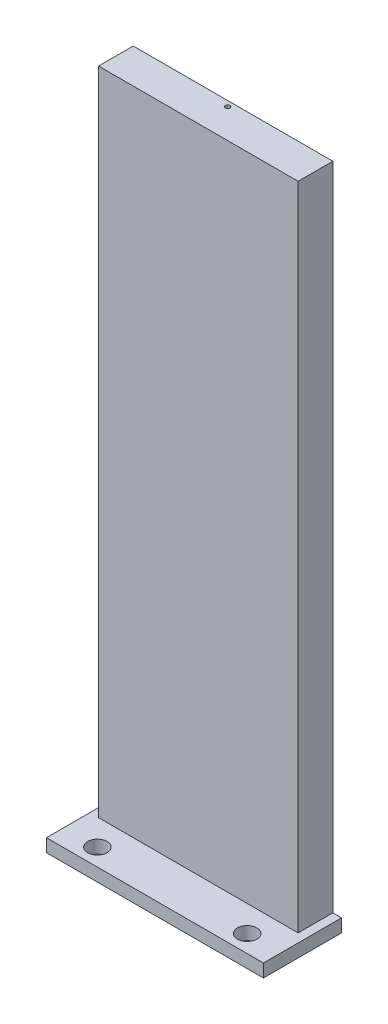
ISO-10303-21;
HEADER;
FILE_DESCRIPTION(('STEP AP214'),'2;1');
FILE_NAME('part.step','',(''),(''),'','','');
FILE_SCHEMA(('AUTOMOTIVE_DESIGN { 1 0 10303 214 1 1 1 1 }'));
ENDSEC;
DATA;
#1=APPLICATION_CONTEXT('core data for automotive mechanical design processes');
#2=APPLICATION_PROTOCOL_DEFINITION('international standard','automotive_design',2000,#1);
#3=PRODUCT_CONTEXT('',#1,'mechanical');
#4=PRODUCT('Part','Part','',(#3));
#5=PRODUCT_RELATED_PRODUCT_CATEGORY('part','',(#4));
#6=PRODUCT_DEFINITION_FORMATION('','',#4);
#7=PRODUCT_DEFINITION_CONTEXT('part definition',#1,'design');
#8=PRODUCT_DEFINITION('design','',#6,#7);
#9=PRODUCT_DEFINITION_SHAPE('','',#8);
#10=(LENGTH_UNIT() NAMED_UNIT(*) SI_UNIT(.MILLI.,.METRE.));
#11=(NAMED_UNIT(*) PLANE_ANGLE_UNIT() SI_UNIT($,.RADIAN.));
#12=(NAMED_UNIT(*) SI_UNIT($,.STERADIAN.) SOLID_ANGLE_UNIT());
#13=UNCERTAINTY_MEASURE_WITH_UNIT(LENGTH_MEASURE(1.E-05),#10,'distance_accuracy_value','');
#14=(GEOMETRIC_REPRESENTATION_CONTEXT(3) GLOBAL_UNCERTAINTY_ASSIGNED_CONTEXT((#13)) GLOBAL_UNIT_ASSIGNED_CONTEXT((#10,
#11,#12)) REPRESENTATION_CONTEXT('',''));
#15=CARTESIAN_POINT('',(0.,0.,0.));
#16=DIRECTION('',(0.,0.,1.));
#17=DIRECTION('',(1.,0.,0.));
#18=AXIS2_PLACEMENT_3D('',#15,#16,#17);
#19=CARTESIAN_POINT('',(-7.22636700217678,3.,-4.3135593220339));
#20=DIRECTION('',(1.,0.,0.));
#21=DIRECTION('',(0.,0.,-1.));
#22=AXIS2_PLACEMENT_3D('',#19,#20,#21);
#23=PLANE('',#22);
#24=DIRECTION('',(0.,0.,1.));
#25=VECTOR('',#24,1.);
#26=CARTESIAN_POINT('',(-7.22636700217678,0.,-4.3135593220339));
#27=LINE('',#26,#25);
#28=CARTESIAN_POINT('',(-7.22636700217678,0.,-14.3135593220339));
#29=VERTEX_POINT('',#28);
#30=CARTESIAN_POINT('',(-7.22636700217678,0.,3.6864406779661));
#31=VERTEX_POINT('',#30);
#32=EDGE_CURVE('E154',#29,#31,#27,.T.);
#33=ORIENTED_EDGE('',*,*,#32,.T.);
#34=DIRECTION('',(0.,-1.,0.));
#35=VECTOR('',#34,1.);
#36=CARTESIAN_POINT('',(-7.22636700217678,3.,3.6864406779661));
#37=LINE('',#36,#35);
#38=CARTESIAN_POINT('',(-7.22636700217678,3.,3.6864406779661));
#39=VERTEX_POINT('',#38);
#40=EDGE_CURVE('E11',#39,#31,#37,.T.);
#41=ORIENTED_EDGE('',*,*,#40,.F.);
#42=DIRECTION('',(0.,0.,1.));
#43=VECTOR('',#42,1.);
#44=CARTESIAN_POINT('',(-7.22636700217678,3.,-4.3135593220339));
#45=LINE('',#44,#43);
#46=CARTESIAN_POINT('',(-7.22636700217678,3.,-14.3135593220339));
#47=VERTEX_POINT('',#46);
#48=EDGE_CURVE('E146',#47,#39,#45,.T.);
#49=ORIENTED_EDGE('',*,*,#48,.F.);
#50=DIRECTION('',(0.,1.,0.));
#51=VECTOR('',#50,1.);
#52=CARTESIAN_POINT('',(-7.22636700217678,0.,-14.3135593220339));
#53=LINE('',#52,#51);
#54=EDGE_CURVE('E120',#29,#47,#53,.T.);
#55=ORIENTED_EDGE('',*,*,#54,.F.);
#56=EDGE_LOOP('',(#33,#41,#49,#55));
#57=FACE_BOUND('',#56,.T.);
#58=ADVANCED_FACE('F33',(#57),#23,.F.);
#59=CARTESIAN_POINT('',(-7.22636700217678,3.,3.6864406779661));
#60=DIRECTION('',(0.,0.,-1.));
#61=DIRECTION('',(-1.,0.,0.));
#62=AXIS2_PLACEMENT_3D('',#59,#60,#61);
#63=PLANE('',#62);
#64=DIRECTION('',(1.,0.,0.));
#65=VECTOR('',#64,1.);
#66=CARTESIAN_POINT('',(-7.22636700217678,0.,3.6864406779661));
#67=LINE('',#66,#65);
#68=CARTESIAN_POINT('',(42.7736329978232,0.,3.6864406779661));
#69=VERTEX_POINT('',#68);
#70=EDGE_CURVE('E157',#31,#69,#67,.T.);
#71=ORIENTED_EDGE('',*,*,#70,.T.);
#72=DIRECTION('',(0.,-1.,0.));
#73=VECTOR('',#72,1.);
#74=CARTESIAN_POINT('',(42.7736329978232,3.,3.6864406779661));
#75=LINE('',#74,#73);
#76=CARTESIAN_POINT('',(42.7736329978232,3.,3.6864406779661));
#77=VERTEX_POINT('',#76);
#78=EDGE_CURVE('E41',#77,#69,#75,.T.);
#79=ORIENTED_EDGE('',*,*,#78,.F.);
#80=DIRECTION('',(1.,0.,0.));
#81=VECTOR('',#80,1.);
#82=CARTESIAN_POINT('',(-7.22636700217678,3.,3.6864406779661));
#83=LINE('',#82,#81);
#84=EDGE_CURVE('E149',#39,#77,#83,.T.);
#85=ORIENTED_EDGE('',*,*,#84,.F.);
#86=ORIENTED_EDGE('',*,*,#40,.T.);
#87=EDGE_LOOP('',(#71,#79,#85,#86));
#88=FACE_BOUND('',#87,.T.);
#89=ADVANCED_FACE('F212',(#88),#63,.F.);
#90=CARTESIAN_POINT('',(42.7736329978232,3.,-4.3135593220339));
#91=DIRECTION('',(-1.,0.,0.));
#92=DIRECTION('',(0.,0.,1.));
#93=AXIS2_PLACEMENT_3D('',#90,#91,#92);
#94=PLANE('',#93);
#95=DIRECTION('',(0.,0.,-1.));
#96=VECTOR('',#95,1.);
#97=CARTESIAN_POINT('',(42.7736329978232,0.,-4.3135593220339));
#98=LINE('',#97,#96);
#99=CARTESIAN_POINT('',(42.7736329978232,0.,-14.3135593220339));
#100=VERTEX_POINT('',#99);
#101=EDGE_CURVE('E150',#69,#100,#98,.T.);
#102=ORIENTED_EDGE('',*,*,#101,.T.);
#103=DIRECTION('',(0.,-1.,0.));
#104=VECTOR('',#103,1.);
#105=CARTESIAN_POINT('',(42.7736329978232,0.,-14.3135593220339));
#106=LINE('',#105,#104);
#107=CARTESIAN_POINT('',(42.7736329978232,3.,-14.3135593220339));
#108=VERTEX_POINT('',#107);
#109=EDGE_CURVE('E131',#108,#100,#106,.T.);
#110=ORIENTED_EDGE('',*,*,#109,.F.);
#111=DIRECTION('',(0.,0.,-1.));
#112=VECTOR('',#111,1.);
#113=CARTESIAN_POINT('',(42.7736329978232,3.,-4.3135593220339));
#114=LINE('',#113,#112);
#115=EDGE_CURVE('E152',#77,#108,#114,.T.);
#116=ORIENTED_EDGE('',*,*,#115,.F.);
#117=ORIENTED_EDGE('',*,*,#78,.T.);
#118=EDGE_LOOP('',(#102,#110,#116,#117));
#119=FACE_BOUND('',#118,.T.);
#120=ADVANCED_FACE('F165',(#119),#94,.F.);
#121=CARTESIAN_POINT('',(0.,3.,0.));
#122=DIRECTION('',(0.,1.,0.));
#123=DIRECTION('',(0.,0.,1.));
#124=AXIS2_PLACEMENT_3D('',#121,#122,#123);
#125=PLANE('',#124);
#126=DIRECTION('',(0.,0.,1.));
#127=VECTOR('',#126,1.);
#128=CARTESIAN_POINT('',(-5.22636700217678,3.,-14.3135593220339));
#129=LINE('',#128,#127);
#130=CARTESIAN_POINT('',(-5.22636700217678,3.,-14.3135593220339));
#131=VERTEX_POINT('',#130);
#132=CARTESIAN_POINT('',(-5.22636700217678,3.,-6.3135593220339));
#133=VERTEX_POINT('',#132);
#134=EDGE_CURVE('E119',#131,#133,#129,.T.);
#135=ORIENTED_EDGE('',*,*,#134,.F.);
#136=DIRECTION('',(1.,0.,0.));
#137=VECTOR('',#136,1.);
#138=CARTESIAN_POINT('',(-7.22636700217678,3.,-14.3135593220339));
#139=LINE('',#138,#137);
#140=EDGE_CURVE('E128',#47,#131,#139,.T.);
#141=ORIENTED_EDGE('',*,*,#140,.F.);
#142=ORIENTED_EDGE('',*,*,#48,.T.);
#143=ORIENTED_EDGE('',*,*,#84,.T.);
#144=ORIENTED_EDGE('',*,*,#115,.T.);
#145=CARTESIAN_POINT('',(40.7736329978232,3.,-14.3135593220339));
#146=VERTEX_POINT('',#145);
#147=EDGE_CURVE('E54',#146,#108,#139,.T.);
#148=ORIENTED_EDGE('',*,*,#147,.F.);
#149=DIRECTION('',(0.,0.,-1.));
#150=VECTOR('',#149,1.);
#151=CARTESIAN_POINT('',(40.7736329978232,3.,-14.3135593220339));
#152=LINE('',#151,#150);
#153=CARTESIAN_POINT('',(40.7736329978232,3.,-6.3135593220339));
#154=VERTEX_POINT('',#153);
#155=EDGE_CURVE('E116',#154,#146,#152,.T.);
#156=ORIENTED_EDGE('',*,*,#155,.F.);
#157=DIRECTION('',(1.,0.,0.));
#158=VECTOR('',#157,1.);
#159=CARTESIAN_POINT('',(-5.22636700217678,3.,-6.3135593220339));
#160=LINE('',#159,#158);
#161=EDGE_CURVE('E48',#133,#154,#160,.T.);
#162=ORIENTED_EDGE('',*,*,#161,.F.);
#163=EDGE_LOOP('',(#135,#141,#142,#143,#144,#148,#156,#162));
#164=FACE_BOUND('',#163,.T.);
#165=CARTESIAN_POINT('',(0.523632997823222,3.,-0.313559322033901));
#166=DIRECTION('',(0.,1.,0.));
#167=DIRECTION('',(0.,0.,1.));
#168=AXIS2_PLACEMENT_3D('',#165,#166,#167);
#169=CIRCLE('',#168,2.2479);
#170=CARTESIAN_POINT('',(0.523632997823222,3.,1.9343406779661));
#171=VERTEX_POINT('',#170);
#172=EDGE_CURVE('E137',#171,#171,#169,.T.);
#173=ORIENTED_EDGE('',*,*,#172,.F.);
#174=EDGE_LOOP('',(#173));
#175=FACE_BOUND('',#174,.T.);
#176=CARTESIAN_POINT('',(35.0236329978232,3.,-0.313559322033901));
#177=DIRECTION('',(0.,1.,0.));
#178=DIRECTION('',(0.,0.,1.));
#179=AXIS2_PLACEMENT_3D('',#176,#177,#178);
#180=CIRCLE('',#179,2.2479);
#181=CARTESIAN_POINT('',(35.0236329978232,3.,1.9343406779661));
#182=VERTEX_POINT('',#181);
#183=EDGE_CURVE('E143',#182,#182,#180,.T.);
#184=ORIENTED_EDGE('',*,*,#183,.F.);
#185=EDGE_LOOP('',(#184));
#186=FACE_BOUND('',#185,.T.);
#187=ADVANCED_FACE('F177',(#164,#175,#186),#125,.T.);
#188=CARTESIAN_POINT('',(0.,0.,0.));
#189=DIRECTION('',(0.,1.,0.));
#190=DIRECTION('',(0.,0.,1.));
#191=AXIS2_PLACEMENT_3D('',#188,#189,#190);
#192=PLANE('',#191);
#193=CARTESIAN_POINT('',(0.523632997823222,0.,-0.313559322033901));
#194=DIRECTION('',(0.,1.,0.));
#195=DIRECTION('',(0.,0.,1.));
#196=AXIS2_PLACEMENT_3D('',#193,#194,#195);
#197=CIRCLE('',#196,2.2479);
#198=CARTESIAN_POINT('',(0.523632997823222,0.,1.9343406779661));
#199=VERTEX_POINT('',#198);
#200=EDGE_CURVE('E140',#199,#199,#197,.T.);
#201=ORIENTED_EDGE('',*,*,#200,.T.);
#202=EDGE_LOOP('',(#201));
#203=FACE_BOUND('',#202,.T.);
#204=CARTESIAN_POINT('',(35.0236329978232,0.,-0.313559322033901));
#205=DIRECTION('',(0.,1.,0.));
#206=DIRECTION('',(0.,0.,1.));
#207=AXIS2_PLACEMENT_3D('',#204,#205,#206);
#208=CIRCLE('',#207,2.2479);
#209=CARTESIAN_POINT('',(35.0236329978232,0.,1.9343406779661));
#210=VERTEX_POINT('',#209);
#211=EDGE_CURVE('E36',#210,#210,#208,.T.);
#212=ORIENTED_EDGE('',*,*,#211,.T.);
#213=EDGE_LOOP('',(#212));
#214=FACE_BOUND('',#213,.T.);
#215=ORIENTED_EDGE('',*,*,#32,.F.);
#216=DIRECTION('',(-1.,0.,0.));
#217=VECTOR('',#216,1.);
#218=CARTESIAN_POINT('',(-7.22636700217678,0.,-14.3135593220339));
#219=LINE('',#218,#217);
#220=EDGE_CURVE('E134',#100,#29,#219,.T.);
#221=ORIENTED_EDGE('',*,*,#220,.F.);
#222=ORIENTED_EDGE('',*,*,#101,.F.);
#223=ORIENTED_EDGE('',*,*,#70,.F.);
#224=EDGE_LOOP('',(#215,#221,#222,#223));
#225=FACE_BOUND('',#224,.T.);
#226=ADVANCED_FACE('F170',(#203,#214,#225),#192,.F.);
#227=CARTESIAN_POINT('',(35.0236329978232,3.,-0.313559322033901));
#228=DIRECTION('',(0.,1.,0.));
#229=DIRECTION('',(0.,0.,1.));
#230=AXIS2_PLACEMENT_3D('',#227,#228,#229);
#231=CYLINDRICAL_SURFACE('',#230,2.2479);
#232=ORIENTED_EDGE('',*,*,#183,.T.);
#233=EDGE_LOOP('',(#232));
#234=FACE_BOUND('',#233,.T.);
#235=ORIENTED_EDGE('',*,*,#211,.F.);
#236=EDGE_LOOP('',(#235));
#237=FACE_BOUND('',#236,.T.);
#238=ADVANCED_FACE('F223',(#234,#237),#231,.F.);
#239=CARTESIAN_POINT('',(0.523632997823222,3.,-0.313559322033901));
#240=DIRECTION('',(0.,1.,0.));
#241=DIRECTION('',(0.,0.,1.));
#242=AXIS2_PLACEMENT_3D('',#239,#240,#241);
#243=CYLINDRICAL_SURFACE('',#242,2.2479);
#244=ORIENTED_EDGE('',*,*,#172,.T.);
#245=EDGE_LOOP('',(#244));
#246=FACE_BOUND('',#245,.T.);
#247=ORIENTED_EDGE('',*,*,#200,.F.);
#248=EDGE_LOOP('',(#247));
#249=FACE_BOUND('',#248,.T.);
#250=ADVANCED_FACE('F229',(#246,#249),#243,.F.);
#251=CARTESIAN_POINT('',(0.,0.,-14.3135593220339));
#252=DIRECTION('',(0.,0.,-1.));
#253=DIRECTION('',(-1.,0.,0.));
#254=AXIS2_PLACEMENT_3D('',#251,#252,#253);
#255=PLANE('',#254);
#256=ORIENTED_EDGE('',*,*,#54,.T.);
#257=ORIENTED_EDGE('',*,*,#140,.T.);
#258=DIRECTION('',(0.,-1.,0.));
#259=VECTOR('',#258,1.);
#260=CARTESIAN_POINT('',(-5.22636700217678,153.,-14.3135593220339));
#261=LINE('',#260,#259);
#262=CARTESIAN_POINT('',(-5.22636700217678,153.,-14.3135593220339));
#263=VERTEX_POINT('',#262);
#264=EDGE_CURVE('E179',#263,#131,#261,.T.);
#265=ORIENTED_EDGE('',*,*,#264,.F.);
#266=DIRECTION('',(-1.,0.,0.));
#267=VECTOR('',#266,1.);
#268=CARTESIAN_POINT('',(-5.22636700217678,153.,-14.3135593220339));
#269=LINE('',#268,#267);
#270=CARTESIAN_POINT('',(40.7736329978232,153.,-14.3135593220339));
#271=VERTEX_POINT('',#270);
#272=EDGE_CURVE('E112',#271,#263,#269,.T.);
#273=ORIENTED_EDGE('',*,*,#272,.F.);
#274=DIRECTION('',(0.,-1.,0.));
#275=VECTOR('',#274,1.);
#276=CARTESIAN_POINT('',(40.7736329978232,153.,-14.3135593220339));
#277=LINE('',#276,#275);
#278=EDGE_CURVE('E124',#271,#146,#277,.T.);
#279=ORIENTED_EDGE('',*,*,#278,.T.);
#280=ORIENTED_EDGE('',*,*,#147,.T.);
#281=ORIENTED_EDGE('',*,*,#109,.T.);
#282=ORIENTED_EDGE('',*,*,#220,.T.);
#283=EDGE_LOOP('',(#256,#257,#265,#273,#279,#280,#281,#282));
#284=FACE_BOUND('',#283,.T.);
#285=ADVANCED_FACE('F173',(#284),#255,.T.);
#286=CARTESIAN_POINT('',(-5.22636700217678,153.,-14.3135593220339));
#287=DIRECTION('',(1.,0.,0.));
#288=DIRECTION('',(0.,0.,-1.));
#289=AXIS2_PLACEMENT_3D('',#286,#287,#288);
#290=PLANE('',#289);
#291=ORIENTED_EDGE('',*,*,#134,.T.);
#292=DIRECTION('',(0.,-1.,0.));
#293=VECTOR('',#292,1.);
#294=CARTESIAN_POINT('',(-5.22636700217678,153.,-6.3135593220339));
#295=LINE('',#294,#293);
#296=CARTESIAN_POINT('',(-5.22636700217678,153.,-6.3135593220339));
#297=VERTEX_POINT('',#296);
#298=EDGE_CURVE('E100',#297,#133,#295,.T.);
#299=ORIENTED_EDGE('',*,*,#298,.F.);
#300=DIRECTION('',(0.,0.,1.));
#301=VECTOR('',#300,1.);
#302=CARTESIAN_POINT('',(-5.22636700217678,153.,-14.3135593220339));
#303=LINE('',#302,#301);
#304=EDGE_CURVE('E107',#263,#297,#303,.T.);
#305=ORIENTED_EDGE('',*,*,#304,.F.);
#306=ORIENTED_EDGE('',*,*,#264,.T.);
#307=EDGE_LOOP('',(#291,#299,#305,#306));
#308=FACE_BOUND('',#307,.T.);
#309=ADVANCED_FACE('F118',(#308),#290,.F.);
#310=CARTESIAN_POINT('',(-5.22636700217678,153.,-6.3135593220339));
#311=DIRECTION('',(0.,0.,-1.));
#312=DIRECTION('',(-1.,0.,0.));
#313=AXIS2_PLACEMENT_3D('',#310,#311,#312);
#314=PLANE('',#313);
#315=ORIENTED_EDGE('',*,*,#161,.T.);
#316=DIRECTION('',(0.,-1.,0.));
#317=VECTOR('',#316,1.);
#318=CARTESIAN_POINT('',(40.7736329978232,153.,-6.3135593220339));
#319=LINE('',#318,#317);
#320=CARTESIAN_POINT('',(40.7736329978232,153.,-6.3135593220339));
#321=VERTEX_POINT('',#320);
#322=EDGE_CURVE('E103',#321,#154,#319,.T.);
#323=ORIENTED_EDGE('',*,*,#322,.F.);
#324=DIRECTION('',(1.,0.,0.));
#325=VECTOR('',#324,1.);
#326=CARTESIAN_POINT('',(-5.22636700217678,153.,-6.3135593220339));
#327=LINE('',#326,#325);
#328=EDGE_CURVE('E96',#297,#321,#327,.T.);
#329=ORIENTED_EDGE('',*,*,#328,.F.);
#330=ORIENTED_EDGE('',*,*,#298,.T.);
#331=EDGE_LOOP('',(#315,#323,#329,#330));
#332=FACE_BOUND('',#331,.T.);
#333=ADVANCED_FACE('F98',(#332),#314,.F.);
#334=CARTESIAN_POINT('',(40.7736329978232,153.,-14.3135593220339));
#335=DIRECTION('',(-1.,0.,0.));
#336=DIRECTION('',(0.,0.,1.));
#337=AXIS2_PLACEMENT_3D('',#334,#335,#336);
#338=PLANE('',#337);
#339=ORIENTED_EDGE('',*,*,#155,.T.);
#340=ORIENTED_EDGE('',*,*,#278,.F.);
#341=DIRECTION('',(0.,0.,-1.));
#342=VECTOR('',#341,1.);
#343=CARTESIAN_POINT('',(40.7736329978232,153.,-14.3135593220339));
#344=LINE('',#343,#342);
#345=EDGE_CURVE('E106',#321,#271,#344,.T.);
#346=ORIENTED_EDGE('',*,*,#345,.F.);
#347=ORIENTED_EDGE('',*,*,#322,.T.);
#348=EDGE_LOOP('',(#339,#340,#346,#347));
#349=FACE_BOUND('',#348,.T.);
#350=ADVANCED_FACE('F204',(#349),#338,.F.);
#351=CARTESIAN_POINT('',(0.,153.,0.));
#352=DIRECTION('',(0.,1.,0.));
#353=DIRECTION('',(0.,0.,1.));
#354=AXIS2_PLACEMENT_3D('',#351,#352,#353);
#355=PLANE('',#354);
#356=CARTESIAN_POINT('',(17.7736329978232,153.,-13.0635593220339));
#357=DIRECTION('',(0.,1.,0.));
#358=DIRECTION('',(0.,0.,1.));
#359=AXIS2_PLACEMENT_3D('',#356,#357,#358);
#360=CIRCLE('',#359,0.5207);
#361=CARTESIAN_POINT('',(17.7736329978232,153.,-12.5428593220339));
#362=VERTEX_POINT('',#361);
#363=EDGE_CURVE('E189',#362,#362,#360,.T.);
#364=ORIENTED_EDGE('',*,*,#363,.F.);
#365=EDGE_LOOP('',(#364));
#366=FACE_BOUND('',#365,.T.);
#367=ORIENTED_EDGE('',*,*,#304,.T.);
#368=ORIENTED_EDGE('',*,*,#328,.T.);
#369=ORIENTED_EDGE('',*,*,#345,.T.);
#370=ORIENTED_EDGE('',*,*,#272,.T.);
#371=EDGE_LOOP('',(#367,#368,#369,#370));
#372=FACE_BOUND('',#371,.T.);
#373=ADVANCED_FACE('F110',(#366,#372),#355,.T.);
#374=CARTESIAN_POINT('',(17.7736329978232,123.,-13.0635593220339));
#375=DIRECTION('',(0.,1.,0.));
#376=DIRECTION('',(0.,0.,1.));
#377=AXIS2_PLACEMENT_3D('',#374,#375,#376);
#378=CYLINDRICAL_SURFACE('',#377,0.5207);
#379=CARTESIAN_POINT('',(17.7736329978232,123.,-13.0635593220339));
#380=DIRECTION('',(0.,1.,0.));
#381=DIRECTION('',(0.,0.,1.));
#382=AXIS2_PLACEMENT_3D('',#379,#380,#381);
#383=CIRCLE('',#382,0.5207);
#384=CARTESIAN_POINT('',(17.7736329978232,123.,-12.5428593220339));
#385=VERTEX_POINT('',#384);
#386=EDGE_CURVE('E186',#385,#385,#383,.T.);
#387=ORIENTED_EDGE('',*,*,#386,.F.);
#388=EDGE_LOOP('',(#387));
#389=FACE_BOUND('',#388,.T.);
#390=ORIENTED_EDGE('',*,*,#363,.T.);
#391=EDGE_LOOP('',(#390));
#392=FACE_BOUND('',#391,.T.);
#393=ADVANCED_FACE('F197',(#389,#392),#378,.F.);
#394=CARTESIAN_POINT('',(17.7736329978232,123.,-13.0635593220339));
#395=DIRECTION('',(0.,1.,0.));
#396=DIRECTION('',(0.,0.,1.));
#397=AXIS2_PLACEMENT_3D('',#394,#395,#396);
#398=PLANE('',#397);
#399=ORIENTED_EDGE('',*,*,#386,.T.);
#400=EDGE_LOOP('',(#399));
#401=FACE_BOUND('',#400,.T.);
#402=ADVANCED_FACE('F195',(#401),#398,.T.);
#403=CLOSED_SHELL('',(#58,#89,#120,#187,#226,#238,#250,#285,#309,#333,#350,#373,#393,#402));
#404=MANIFOLD_SOLID_BREP('B2',#403);
#405=ADVANCED_BREP_SHAPE_REPRESENTATION('',(#18,#404),#14);
#406=SHAPE_DEFINITION_REPRESENTATION(#9,#405);
ENDSEC;
END-ISO-10303-21;
